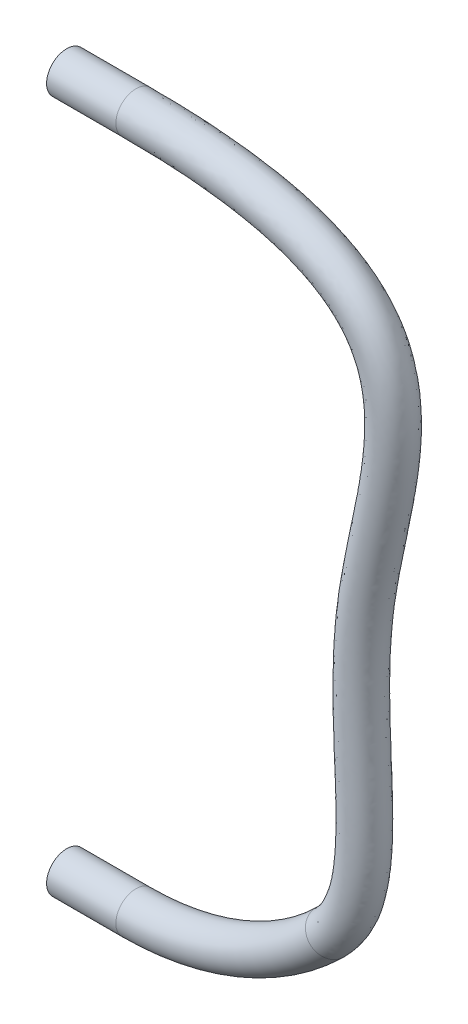
ISO-10303-21;
HEADER;
FILE_DESCRIPTION(('STEP AP214'),'2;1');
FILE_NAME('part.step','',(''),(''),'','','');
FILE_SCHEMA(('AUTOMOTIVE_DESIGN { 1 0 10303 214 1 1 1 1 }'));
ENDSEC;
DATA;
#1=APPLICATION_CONTEXT('core data for automotive mechanical design processes');
#2=APPLICATION_PROTOCOL_DEFINITION('international standard','automotive_design',2000,#1);
#3=PRODUCT_CONTEXT('',#1,'mechanical');
#4=PRODUCT('Part','Part','',(#3));
#5=PRODUCT_RELATED_PRODUCT_CATEGORY('part','',(#4));
#6=PRODUCT_DEFINITION_FORMATION('','',#4);
#7=PRODUCT_DEFINITION_CONTEXT('part definition',#1,'design');
#8=PRODUCT_DEFINITION('design','',#6,#7);
#9=PRODUCT_DEFINITION_SHAPE('','',#8);
#10=(LENGTH_UNIT() NAMED_UNIT(*) SI_UNIT(.MILLI.,.METRE.));
#11=(NAMED_UNIT(*) PLANE_ANGLE_UNIT() SI_UNIT($,.RADIAN.));
#12=(NAMED_UNIT(*) SI_UNIT($,.STERADIAN.) SOLID_ANGLE_UNIT());
#13=UNCERTAINTY_MEASURE_WITH_UNIT(LENGTH_MEASURE(1.E-05),#10,'distance_accuracy_value','');
#14=(GEOMETRIC_REPRESENTATION_CONTEXT(3) GLOBAL_UNCERTAINTY_ASSIGNED_CONTEXT((#13)) GLOBAL_UNIT_ASSIGNED_CONTEXT((#10,
#11,#12)) REPRESENTATION_CONTEXT('',''));
#15=CARTESIAN_POINT('',(0.,0.,0.));
#16=DIRECTION('',(0.,0.,1.));
#17=DIRECTION('',(1.,0.,0.));
#18=AXIS2_PLACEMENT_3D('',#15,#16,#17);
#19=CARTESIAN_POINT('',(49.9999999999996,500.,0.));
#20=DIRECTION('',(-1.,0.,0.));
#21=DIRECTION('',(0.,0.,1.));
#22=AXIS2_PLACEMENT_3D('',#19,#20,#21);
#23=CYLINDRICAL_SURFACE('',#22,14.5);
#24=CARTESIAN_POINT('',(49.9999999999996,500.,0.));
#25=DIRECTION('',(-1.,0.,0.));
#26=DIRECTION('',(0.,0.,-1.));
#27=AXIS2_PLACEMENT_3D('',#24,#25,#26);
#28=CIRCLE('',#27,14.5);
#29=CARTESIAN_POINT('',(49.9999999999996,500.,14.5));
#30=VERTEX_POINT('',#29);
#31=EDGE_CURVE('E69',#30,#30,#28,.T.);
#32=CARTESIAN_POINT('',(-3.95516952522712E-13,500.,0.));
#33=DIRECTION('',(-1.,0.,0.));
#34=DIRECTION('',(0.,0.,-1.));
#35=AXIS2_PLACEMENT_3D('',#32,#33,#34);
#36=CIRCLE('',#35,14.5);
#37=CARTESIAN_POINT('',(-3.95516952522712E-13,500.,14.5));
#38=VERTEX_POINT('',#37);
#39=EDGE_CURVE('E11',#38,#38,#36,.T.);
#40=CARTESIAN_POINT('',(49.9999999999996,500.,14.5));
#41=CARTESIAN_POINT('',(49.4791666666663,500.,14.5));
#42=CARTESIAN_POINT('',(48.9583333333329,500.,14.5));
#43=CARTESIAN_POINT('',(47.9166666666663,500.,14.5));
#44=CARTESIAN_POINT('',(47.3958333333329,500.,14.5));
#45=CARTESIAN_POINT('',(46.3541666666663,500.,14.5));
#46=CARTESIAN_POINT('',(45.8333333333329,500.,14.5));
#47=CARTESIAN_POINT('',(44.7916666666663,500.,14.5));
#48=CARTESIAN_POINT('',(44.2708333333329,500.,14.5));
#49=CARTESIAN_POINT('',(43.2291666666663,500.,14.5));
#50=CARTESIAN_POINT('',(42.7083333333329,500.,14.5));
#51=CARTESIAN_POINT('',(41.6666666666663,500.,14.5));
#52=CARTESIAN_POINT('',(41.1458333333329,500.,14.5));
#53=CARTESIAN_POINT('',(40.1041666666663,500.,14.5));
#54=CARTESIAN_POINT('',(39.5833333333329,500.,14.5));
#55=CARTESIAN_POINT('',(38.5416666666663,500.,14.5));
#56=CARTESIAN_POINT('',(38.0208333333329,500.,14.5));
#57=CARTESIAN_POINT('',(36.9791666666663,500.,14.5));
#58=CARTESIAN_POINT('',(36.4583333333329,500.,14.5));
#59=CARTESIAN_POINT('',(35.4166666666663,500.,14.5));
#60=CARTESIAN_POINT('',(34.8958333333329,500.,14.5));
#61=CARTESIAN_POINT('',(33.8541666666663,500.,14.5));
#62=CARTESIAN_POINT('',(33.3333333333329,500.,14.5));
#63=CARTESIAN_POINT('',(32.2916666666663,500.,14.5));
#64=CARTESIAN_POINT('',(31.7708333333329,500.,14.5));
#65=CARTESIAN_POINT('',(30.7291666666663,500.,14.5));
#66=CARTESIAN_POINT('',(30.2083333333329,500.,14.5));
#67=CARTESIAN_POINT('',(29.1666666666663,500.,14.5));
#68=CARTESIAN_POINT('',(28.6458333333329,500.,14.5));
#69=CARTESIAN_POINT('',(27.6041666666663,500.,14.5));
#70=CARTESIAN_POINT('',(27.0833333333329,500.,14.5));
#71=CARTESIAN_POINT('',(26.0416666666663,500.,14.5));
#72=CARTESIAN_POINT('',(25.5208333333329,500.,14.5));
#73=CARTESIAN_POINT('',(24.4791666666663,500.,14.5));
#74=CARTESIAN_POINT('',(23.9583333333329,500.,14.5));
#75=CARTESIAN_POINT('',(22.9166666666663,500.,14.5));
#76=CARTESIAN_POINT('',(22.3958333333329,500.,14.5));
#77=CARTESIAN_POINT('',(21.3541666666663,500.,14.5));
#78=CARTESIAN_POINT('',(20.8333333333329,500.,14.5));
#79=CARTESIAN_POINT('',(19.7916666666663,500.,14.5));
#80=CARTESIAN_POINT('',(19.2708333333329,500.,14.5));
#81=CARTESIAN_POINT('',(18.2291666666663,500.,14.5));
#82=CARTESIAN_POINT('',(17.7083333333329,500.,14.5));
#83=CARTESIAN_POINT('',(16.6666666666663,500.,14.5));
#84=CARTESIAN_POINT('',(16.1458333333329,500.,14.5));
#85=CARTESIAN_POINT('',(15.1041666666663,500.,14.5));
#86=CARTESIAN_POINT('',(14.5833333333329,500.,14.5));
#87=CARTESIAN_POINT('',(13.5416666666663,500.,14.5));
#88=CARTESIAN_POINT('',(13.0208333333329,500.,14.5));
#89=CARTESIAN_POINT('',(11.9791666666663,500.,14.5));
#90=CARTESIAN_POINT('',(11.4583333333329,500.,14.5));
#91=CARTESIAN_POINT('',(10.4166666666663,500.,14.5));
#92=CARTESIAN_POINT('',(9.89583333333294,500.,14.5));
#93=CARTESIAN_POINT('',(8.85416666666627,500.,14.5));
#94=CARTESIAN_POINT('',(8.33333333333294,500.,14.5));
#95=CARTESIAN_POINT('',(7.29166666666627,500.,14.5));
#96=CARTESIAN_POINT('',(6.77083333333294,500.,14.5));
#97=CARTESIAN_POINT('',(5.72916666666627,500.,14.5));
#98=CARTESIAN_POINT('',(5.20833333333294,500.,14.5));
#99=CARTESIAN_POINT('',(4.16666666666627,500.,14.5));
#100=CARTESIAN_POINT('',(3.64583333333294,500.,14.5));
#101=CARTESIAN_POINT('',(2.60416666666627,500.,14.5));
#102=CARTESIAN_POINT('',(2.08333333333294,500.,14.5));
#103=CARTESIAN_POINT('',(1.04166666666627,500.,14.5));
#104=CARTESIAN_POINT('',(0.520833333332938,500.,14.5));
#105=CARTESIAN_POINT('',(-3.95516952522712E-13,500.,14.5));
#106=B_SPLINE_CURVE_WITH_KNOTS('',3,(#40,#41,#42,#43,#44,#45,#46,#47,#48,#49,#50,#51,#52,#53,
#54,#55,#56,#57,#58,#59,#60,#61,#62,#63,#64,#65,#66,#67,#68,#69,#70,#71,#72,#73,#74,#75,#76,#77,
#78,#79,#80,#81,#82,#83,#84,#85,#86,#87,#88,#89,#90,#91,#92,#93,#94,#95,#96,#97,#98,#99,#100,
#101,#102,#103,#104,#105),.UNSPECIFIED.,.F.,.F.,(4,2,2,2,2,2,2,2,2,2,2,2,2,2,2,2,2,2,2,2,2,2,2,
2,2,2,2,2,2,2,2,2,4),(0.,1.56249999999999,3.125,4.6875,6.25,7.81249999999999,9.37499999999999,
10.9375,12.5,14.0625,15.625,17.1875,18.75,20.3125,21.875,23.4375,25.,26.5625,28.125,29.6875,
31.25,32.8125,34.375,35.9375,37.5,39.0625,40.625,42.1875,43.75,45.3125,46.875,48.4375,50.),.UNSPECIFIED.);
#107=EDGE_CURVE('BSEAM51',#30,#38,#106,.T.);
#108=ORIENTED_EDGE('',*,*,#31,.T.);
#109=ORIENTED_EDGE('',*,*,#39,.F.);
#110=ORIENTED_EDGE('',*,*,#107,.T.);
#111=ORIENTED_EDGE('',*,*,#107,.F.);
#112=EDGE_LOOP('',(#108,#110,#109,#111));
#113=FACE_BOUND('',#112,.T.);
#114=ADVANCED_FACE('F51',(#113),#23,.T.);
#115=CARTESIAN_POINT('',(50.,200.,0.));
#116=DIRECTION('',(0.,0.,1.));
#117=DIRECTION('',(1.,0.,0.));
#118=AXIS2_PLACEMENT_3D('',#115,#116,#117);
#119=TOROIDAL_SURFACE('',#118,200.,14.5);
#120=CARTESIAN_POINT('',(50.,0.,0.));
#121=DIRECTION('',(1.,0.,0.));
#122=DIRECTION('',(0.,0.,-1.));
#123=AXIS2_PLACEMENT_3D('',#120,#121,#122);
#124=CIRCLE('',#123,14.5);
#125=CARTESIAN_POINT('',(50.,-14.5,0.));
#126=VERTEX_POINT('',#125);
#127=EDGE_CURVE('E61',#126,#126,#124,.T.);
#128=CARTESIAN_POINT('',(190.,57.171431429143,0.));
#129=DIRECTION('',(0.714142842854285,0.7,0.));
#130=DIRECTION('',(0.,0.,-1.));
#131=AXIS2_PLACEMENT_3D('',#128,#129,#130);
#132=CIRCLE('',#131,14.5);
#133=CARTESIAN_POINT('',(200.15,46.8163602077558,0.));
#134=VERTEX_POINT('',#133);
#135=EDGE_CURVE('E57',#134,#134,#132,.T.);
#136=CARTESIAN_POINT('',(50.,200.,0.));
#137=DIRECTION('',(0.,0.,1.));
#138=DIRECTION('',(1.,0.,0.));
#139=AXIS2_PLACEMENT_3D('',#136,#137,#138);
#140=CIRCLE('',#139,214.5);
#141=EDGE_CURVE('',#126,#134,#140,.T.);
#142=ORIENTED_EDGE('',*,*,#127,.T.);
#143=ORIENTED_EDGE('',*,*,#135,.F.);
#144=ORIENTED_EDGE('',*,*,#141,.T.);
#145=ORIENTED_EDGE('',*,*,#141,.F.);
#146=EDGE_LOOP('',(#142,#144,#143,#145));
#147=FACE_BOUND('',#146,.T.);
#148=ADVANCED_FACE('F88',(#147),#119,.T.);
#149=CARTESIAN_POINT('',(50.,0.,0.));
#150=DIRECTION('',(-1.,0.,0.));
#151=DIRECTION('',(0.,0.,1.));
#152=AXIS2_PLACEMENT_3D('',#149,#150,#151);
#153=CYLINDRICAL_SURFACE('',#152,14.5);
#154=ORIENTED_EDGE('',*,*,#127,.F.);
#155=EDGE_LOOP('',(#154));
#156=FACE_BOUND('',#155,.T.);
#157=CARTESIAN_POINT('',(0.,0.,0.));
#158=DIRECTION('',(1.,0.,0.));
#159=DIRECTION('',(0.,0.,-1.));
#160=AXIS2_PLACEMENT_3D('',#157,#158,#159);
#161=CIRCLE('',#160,14.5);
#162=CARTESIAN_POINT('',(0.,0.,-14.5));
#163=VERTEX_POINT('',#162);
#164=EDGE_CURVE('E65',#163,#163,#161,.T.);
#165=ORIENTED_EDGE('',*,*,#164,.T.);
#166=EDGE_LOOP('',(#165));
#167=FACE_BOUND('',#166,.T.);
#168=ADVANCED_FACE('F92',(#156,#167),#153,.T.);
#169=CARTESIAN_POINT('',(0.,0.,0.));
#170=DIRECTION('',(1.,0.,0.));
#171=DIRECTION('',(0.,0.,-1.));
#172=AXIS2_PLACEMENT_3D('',#169,#170,#171);
#173=PLANE('',#172);
#174=ORIENTED_EDGE('',*,*,#164,.F.);
#175=EDGE_LOOP('',(#174));
#176=FACE_BOUND('',#175,.T.);
#177=ADVANCED_FACE('F83',(#176),#173,.F.);
#178=CARTESIAN_POINT('',(-3.95516952522712E-13,500.,0.));
#179=DIRECTION('',(-1.,0.,0.));
#180=DIRECTION('',(0.,0.,-1.));
#181=AXIS2_PLACEMENT_3D('',#178,#179,#180);
#182=PLANE('',#181);
#183=ORIENTED_EDGE('',*,*,#39,.T.);
#184=EDGE_LOOP('',(#183));
#185=FACE_BOUND('',#184,.T.);
#186=ADVANCED_FACE('F78',(#185),#182,.T.);
#187=CARTESIAN_POINT('',(190.,57.171431429143,-14.5));
#188=CARTESIAN_POINT('',(194.944842449833,62.0183465099527,-14.5));
#189=CARTESIAN_POINT('',(202.951550368549,72.6929623445116,-14.5));
#190=CARTESIAN_POINT('',(210.31382625523,91.4075178971451,-14.5));
#191=CARTESIAN_POINT('',(214.029461101954,112.584980032532,-14.5));
#192=CARTESIAN_POINT('',(215.863984687444,152.700368889867,-14.5));
#193=CARTESIAN_POINT('',(211.280771673984,206.672860303372,-14.5));
#194=CARTESIAN_POINT('',(213.566897052587,258.982853629339,-14.5));
#195=CARTESIAN_POINT('',(219.6745617368,300.751303923281,-14.5));
#196=CARTESIAN_POINT('',(228.070292093363,336.023093604827,-14.5));
#197=CARTESIAN_POINT('',(235.140291346087,377.834515537395,-14.5));
#198=CARTESIAN_POINT('',(236.335787132934,408.040783120431,-14.5));
#199=CARTESIAN_POINT('',(231.831090363544,430.49628507942,-14.5));
#200=CARTESIAN_POINT('',(224.082473035944,446.277167583779,-14.5));
#201=CARTESIAN_POINT('',(216.420618309054,456.714655245031,-14.5));
#202=CARTESIAN_POINT('',(206.399580794928,466.235012824428,-14.5));
#203=CARTESIAN_POINT('',(193.787305770649,474.755681510549,-14.5));
#204=CARTESIAN_POINT('',(174.921612456109,483.847084932289,-14.5));
#205=CARTESIAN_POINT('',(146.74142116915,492.348139726263,-14.5));
#206=CARTESIAN_POINT('',(104.664413539392,498.539258728495,-14.5));
#207=CARTESIAN_POINT('',(69.5225886398515,500.,-14.5));
#208=CARTESIAN_POINT('',(49.9999999999996,500.,-14.5));
#209=CARTESIAN_POINT('',(169.7,77.8815738719173,-14.5));
#210=CARTESIAN_POINT('',(174.644842449833,82.728488952727,-14.5));
#211=CARTESIAN_POINT('',(176.230611912776,85.843605342476,-14.5));
#212=CARTESIAN_POINT('',(182.332309903121,99.0837889498667,-14.5));
#213=CARTESIAN_POINT('',(185.0208752628,115.286778973782,-14.5));
#214=CARTESIAN_POINT('',(186.887253376729,150.924680172337,-14.5));
#215=CARTESIAN_POINT('',(182.133285549426,204.768076251786,-14.5));
#216=CARTESIAN_POINT('',(184.748735663511,261.950203556697,-14.5));
#217=CARTESIAN_POINT('',(191.15479980805,306.446688638503,-14.5));
#218=CARTESIAN_POINT('',(199.82131627766,342.618763312055,-14.5));
#219=CARTESIAN_POINT('',(206.287671065404,381.34541559297,-14.5));
#220=CARTESIAN_POINT('',(207.110284171086,406.509956650255,-14.5));
#221=CARTESIAN_POINT('',(203.803730261991,421.741423388913,-14.5));
#222=CARTESIAN_POINT('',(199.147742739472,431.164642376791,-14.5));
#223=CARTESIAN_POINT('',(194.618243954749,437.354918237821,-14.5));
#224=CARTESIAN_POINT('',(188.308717536378,443.396620476437,-14.5));
#225=CARTESIAN_POINT('',(179.496918086823,449.405585731971,-14.5));
#226=CARTESIAN_POINT('',(164.899448228437,456.488020905377,-14.5));
#227=CARTESIAN_POINT('',(140.969785721538,463.848970750561,-14.5));
#228=CARTESIAN_POINT('',(101.934320374639,469.589409808704,-14.5));
#229=CARTESIAN_POINT('',(69.5225886398517,471.,-14.5));
#230=CARTESIAN_POINT('',(49.9999999999998,471.,-14.5));
#231=CARTESIAN_POINT('',(169.7,77.8815738719173,14.5));
#232=CARTESIAN_POINT('',(174.644842449833,82.728488952727,14.5));
#233=CARTESIAN_POINT('',(176.230611912776,85.843605342476,14.5));
#234=CARTESIAN_POINT('',(182.332309903121,99.0837889498667,14.5));
#235=CARTESIAN_POINT('',(185.0208752628,115.286778973782,14.5));
#236=CARTESIAN_POINT('',(186.887253376729,150.924680172337,14.5));
#237=CARTESIAN_POINT('',(182.133285549426,204.768076251786,14.5));
#238=CARTESIAN_POINT('',(184.748735663511,261.950203556697,14.5));
#239=CARTESIAN_POINT('',(191.15479980805,306.446688638503,14.5));
#240=CARTESIAN_POINT('',(199.82131627766,342.618763312055,14.5));
#241=CARTESIAN_POINT('',(206.287671065404,381.34541559297,14.5));
#242=CARTESIAN_POINT('',(207.110284171086,406.509956650255,14.5));
#243=CARTESIAN_POINT('',(203.803730261991,421.741423388913,14.5));
#244=CARTESIAN_POINT('',(199.147742739472,431.164642376791,14.5));
#245=CARTESIAN_POINT('',(194.618243954749,437.354918237821,14.5));
#246=CARTESIAN_POINT('',(188.308717536378,443.396620476437,14.5));
#247=CARTESIAN_POINT('',(179.496918086823,449.405585731971,14.5));
#248=CARTESIAN_POINT('',(164.899448228437,456.488020905377,14.5));
#249=CARTESIAN_POINT('',(140.969785721538,463.848970750561,14.5));
#250=CARTESIAN_POINT('',(101.934320374639,469.589409808704,14.5));
#251=CARTESIAN_POINT('',(69.5225886398517,471.,14.5));
#252=CARTESIAN_POINT('',(49.9999999999998,471.,14.5));
#253=CARTESIAN_POINT('',(190.,57.171431429143,14.5));
#254=CARTESIAN_POINT('',(194.944842449833,62.0183465099527,14.5));
#255=CARTESIAN_POINT('',(202.951550368549,72.6929623445116,14.5));
#256=CARTESIAN_POINT('',(210.31382625523,91.4075178971451,14.5));
#257=CARTESIAN_POINT('',(214.029461101954,112.584980032532,14.5));
#258=CARTESIAN_POINT('',(215.863984687444,152.700368889867,14.5));
#259=CARTESIAN_POINT('',(211.280771673984,206.672860303372,14.5));
#260=CARTESIAN_POINT('',(213.566897052587,258.982853629339,14.5));
#261=CARTESIAN_POINT('',(219.6745617368,300.751303923281,14.5));
#262=CARTESIAN_POINT('',(228.070292093363,336.023093604827,14.5));
#263=CARTESIAN_POINT('',(235.140291346087,377.834515537395,14.5));
#264=CARTESIAN_POINT('',(236.335787132934,408.040783120431,14.5));
#265=CARTESIAN_POINT('',(231.831090363544,430.49628507942,14.5));
#266=CARTESIAN_POINT('',(224.082473035944,446.277167583779,14.5));
#267=CARTESIAN_POINT('',(216.420618309054,456.714655245031,14.5));
#268=CARTESIAN_POINT('',(206.399580794928,466.235012824428,14.5));
#269=CARTESIAN_POINT('',(193.787305770649,474.755681510549,14.5));
#270=CARTESIAN_POINT('',(174.921612456109,483.847084932289,14.5));
#271=CARTESIAN_POINT('',(146.74142116915,492.348139726263,14.5));
#272=CARTESIAN_POINT('',(104.664413539392,498.539258728495,14.5));
#273=CARTESIAN_POINT('',(69.5225886398515,500.,14.5));
#274=CARTESIAN_POINT('',(49.9999999999996,500.,14.5));
#275=CARTESIAN_POINT('',(210.3,36.4612889863687,14.5));
#276=CARTESIAN_POINT('',(215.244842449833,41.3082040671785,14.5));
#277=CARTESIAN_POINT('',(229.672488824321,59.5423193465473,14.5));
#278=CARTESIAN_POINT('',(238.295342607339,83.7312468444234,14.5));
#279=CARTESIAN_POINT('',(243.038046941108,109.883181091283,14.5));
#280=CARTESIAN_POINT('',(244.840715998159,154.476057607397,14.5));
#281=CARTESIAN_POINT('',(240.428257798541,208.577644354958,14.5));
#282=CARTESIAN_POINT('',(242.385058441662,256.015503701982,14.5));
#283=CARTESIAN_POINT('',(248.194323665551,295.055919208058,14.5));
#284=CARTESIAN_POINT('',(256.319267909066,329.4274238976,14.5));
#285=CARTESIAN_POINT('',(263.99291162677,374.323615481819,14.5));
#286=CARTESIAN_POINT('',(265.561290094783,409.571609590608,14.5));
#287=CARTESIAN_POINT('',(259.858450465097,439.251146769926,14.5));
#288=CARTESIAN_POINT('',(249.017203332416,461.389692790767,14.5));
#289=CARTESIAN_POINT('',(238.222992663359,476.074392252241,14.5));
#290=CARTESIAN_POINT('',(224.490444053477,489.073405172419,14.5));
#291=CARTESIAN_POINT('',(208.077693454475,500.105777289127,14.5));
#292=CARTESIAN_POINT('',(184.943776683782,511.206148959202,14.5));
#293=CARTESIAN_POINT('',(152.513056616762,520.847308701964,14.5));
#294=CARTESIAN_POINT('',(107.394506704145,527.489107648285,14.5));
#295=CARTESIAN_POINT('',(69.5225886398513,529.,14.5));
#296=CARTESIAN_POINT('',(49.9999999999994,529.,14.5));
#297=CARTESIAN_POINT('',(210.3,36.4612889863687,-14.5));
#298=CARTESIAN_POINT('',(215.244842449833,41.3082040671785,-14.5));
#299=CARTESIAN_POINT('',(229.672488824321,59.5423193465473,-14.5));
#300=CARTESIAN_POINT('',(238.295342607339,83.7312468444234,-14.5));
#301=CARTESIAN_POINT('',(243.038046941108,109.883181091283,-14.5));
#302=CARTESIAN_POINT('',(244.840715998159,154.476057607397,-14.5));
#303=CARTESIAN_POINT('',(240.428257798541,208.577644354958,-14.5));
#304=CARTESIAN_POINT('',(242.385058441662,256.015503701982,-14.5));
#305=CARTESIAN_POINT('',(248.194323665551,295.055919208058,-14.5));
#306=CARTESIAN_POINT('',(256.319267909066,329.4274238976,-14.5));
#307=CARTESIAN_POINT('',(263.99291162677,374.323615481819,-14.5));
#308=CARTESIAN_POINT('',(265.561290094783,409.571609590608,-14.5));
#309=CARTESIAN_POINT('',(259.858450465097,439.251146769926,-14.5));
#310=CARTESIAN_POINT('',(249.017203332416,461.389692790767,-14.5));
#311=CARTESIAN_POINT('',(238.222992663359,476.074392252241,-14.5));
#312=CARTESIAN_POINT('',(224.490444053477,489.073405172419,-14.5));
#313=CARTESIAN_POINT('',(208.077693454475,500.105777289127,-14.5));
#314=CARTESIAN_POINT('',(184.943776683782,511.206148959202,-14.5));
#315=CARTESIAN_POINT('',(152.513056616762,520.847308701964,-14.5));
#316=CARTESIAN_POINT('',(107.394506704145,527.489107648285,-14.5));
#317=CARTESIAN_POINT('',(69.5225886398513,529.,-14.5));
#318=CARTESIAN_POINT('',(49.9999999999994,529.,-14.5));
#319=CARTESIAN_POINT('',(190.,57.171431429143,-14.5));
#320=CARTESIAN_POINT('',(194.944842449833,62.0183465099527,-14.5));
#321=CARTESIAN_POINT('',(202.951550368549,72.6929623445116,-14.5));
#322=CARTESIAN_POINT('',(210.31382625523,91.4075178971451,-14.5));
#323=CARTESIAN_POINT('',(214.029461101954,112.584980032532,-14.5));
#324=CARTESIAN_POINT('',(215.863984687444,152.700368889867,-14.5));
#325=CARTESIAN_POINT('',(211.280771673984,206.672860303372,-14.5));
#326=CARTESIAN_POINT('',(213.566897052587,258.982853629339,-14.5));
#327=CARTESIAN_POINT('',(219.6745617368,300.751303923281,-14.5));
#328=CARTESIAN_POINT('',(228.070292093363,336.023093604827,-14.5));
#329=CARTESIAN_POINT('',(235.140291346087,377.834515537395,-14.5));
#330=CARTESIAN_POINT('',(236.335787132934,408.040783120431,-14.5));
#331=CARTESIAN_POINT('',(231.831090363544,430.49628507942,-14.5));
#332=CARTESIAN_POINT('',(224.082473035944,446.277167583779,-14.5));
#333=CARTESIAN_POINT('',(216.420618309054,456.714655245031,-14.5));
#334=CARTESIAN_POINT('',(206.399580794928,466.235012824428,-14.5));
#335=CARTESIAN_POINT('',(193.787305770649,474.755681510549,-14.5));
#336=CARTESIAN_POINT('',(174.921612456109,483.847084932289,-14.5));
#337=CARTESIAN_POINT('',(146.74142116915,492.348139726263,-14.5));
#338=CARTESIAN_POINT('',(104.664413539392,498.539258728495,-14.5));
#339=CARTESIAN_POINT('',(69.5225886398515,500.,-14.5));
#340=CARTESIAN_POINT('',(49.9999999999996,500.,-14.5));
#341=(BOUNDED_SURFACE() B_SPLINE_SURFACE(3,3,((#187,#188,#189,#190,#191,#192,#193,#194,#195,
#196,#197,#198,#199,#200,#201,#202,#203,#204,#205,#206,#207,#208),(#209,#210,#211,#212,#213,
#214,#215,#216,#217,#218,#219,#220,#221,#222,#223,#224,#225,#226,#227,#228,#229,#230),(#231,
#232,#233,#234,#235,#236,#237,#238,#239,#240,#241,#242,#243,#244,#245,#246,#247,#248,#249,#250,
#251,#252),(#253,#254,#255,#256,#257,#258,#259,#260,#261,#262,#263,#264,#265,#266,#267,#268,
#269,#270,#271,#272,#273,#274),(#275,#276,#277,#278,#279,#280,#281,#282,#283,#284,#285,#286,
#287,#288,#289,#290,#291,#292,#293,#294,#295,#296),(#297,#298,#299,#300,#301,#302,#303,#304,
#305,#306,#307,#308,#309,#310,#311,#312,#313,#314,#315,#316,#317,#318),(#319,#320,#321,#322,
#323,#324,#325,#326,#327,#328,#329,#330,#331,#332,#333,#334,#335,#336,#337,#338,#339,#340)),
.UNSPECIFIED.,.T.,.F.,.F.) B_SPLINE_SURFACE_WITH_KNOTS((4,3,4),(4,1,1,1,1,1,1,1,1,1,1,1,1,1,1,1,
1,1,1,4),(0.,0.5,1.),(0.,0.052500000000028,0.105,0.1575,0.21,0.375,0.466511448766878,0.48,
0.584999999999983,0.64,0.695,0.75,0.775,0.8,0.825,0.85,0.875,0.916666666666679,
0.958333333333333,1.),
.UNSPECIFIED.) GEOMETRIC_REPRESENTATION_ITEM() RATIONAL_B_SPLINE_SURFACE(((1.,1.,1.,1.,1.,1.,1.,
1.,1.,1.,1.,1.,1.,1.,1.,1.,1.,1.,1.,1.,1.,1.),(0.333333333333333,0.333333333333333,
0.333333333333334,0.333333333333333,0.333333333333333,0.333333333333333,0.333333333333333,
0.333333333333333,0.333333333333333,0.333333333333333,0.333333333333333,0.333333333333333,
0.333333333333333,0.333333333333333,0.333333333333333,0.333333333333333,0.333333333333333,
0.333333333333333,0.333333333333333,0.333333333333333,0.333333333333333,0.333333333333333),
(0.333333333333333,0.333333333333333,0.333333333333334,0.333333333333333,0.333333333333333,
0.333333333333333,0.333333333333333,0.333333333333333,0.333333333333333,0.333333333333333,
0.333333333333333,0.333333333333333,0.333333333333333,0.333333333333333,0.333333333333333,
0.333333333333333,0.333333333333333,0.333333333333333,0.333333333333333,0.333333333333333,
0.333333333333333,0.333333333333333),(1.,1.,1.,1.,1.,1.,1.,1.,1.,1.,1.,1.,1.,1.,1.,1.,1.,1.,1.,
1.,1.,1.),(0.333333333333333,0.333333333333333,0.333333333333334,0.333333333333333,
0.333333333333333,0.333333333333333,0.333333333333333,0.333333333333333,0.333333333333333,
0.333333333333333,0.333333333333333,0.333333333333333,0.333333333333333,0.333333333333333,
0.333333333333333,0.333333333333333,0.333333333333333,0.333333333333333,0.333333333333333,
0.333333333333333,0.333333333333333,0.333333333333333),(0.333333333333333,0.333333333333333,
0.333333333333334,0.333333333333333,0.333333333333333,0.333333333333333,0.333333333333333,
0.333333333333333,0.333333333333333,0.333333333333333,0.333333333333333,0.333333333333333,
0.333333333333333,0.333333333333333,0.333333333333333,0.333333333333333,0.333333333333333,
0.333333333333333,0.333333333333333,0.333333333333333,0.333333333333333,0.333333333333333),(1.,
1.,1.,1.,1.,1.,1.,1.,1.,1.,1.,1.,1.,1.,1.,1.,1.,1.,1.,1.,1.,1.))) REPRESENTATION_ITEM('') SURFACE());
#342=ORIENTED_EDGE('',*,*,#135,.T.);
#343=EDGE_LOOP('',(#342));
#344=FACE_BOUND('',#343,.T.);
#345=ORIENTED_EDGE('',*,*,#31,.F.);
#346=EDGE_LOOP('',(#345));
#347=FACE_BOUND('',#346,.T.);
#348=ADVANCED_FACE('F76',(#344,#347),#341,.T.);
#349=CLOSED_SHELL('',(#114,#148,#168,#177,#186,#348));
#350=MANIFOLD_SOLID_BREP('B2',#349);
#351=ADVANCED_BREP_SHAPE_REPRESENTATION('',(#18,#350),#14);
#352=SHAPE_DEFINITION_REPRESENTATION(#9,#351);
ENDSEC;
END-ISO-10303-21;
